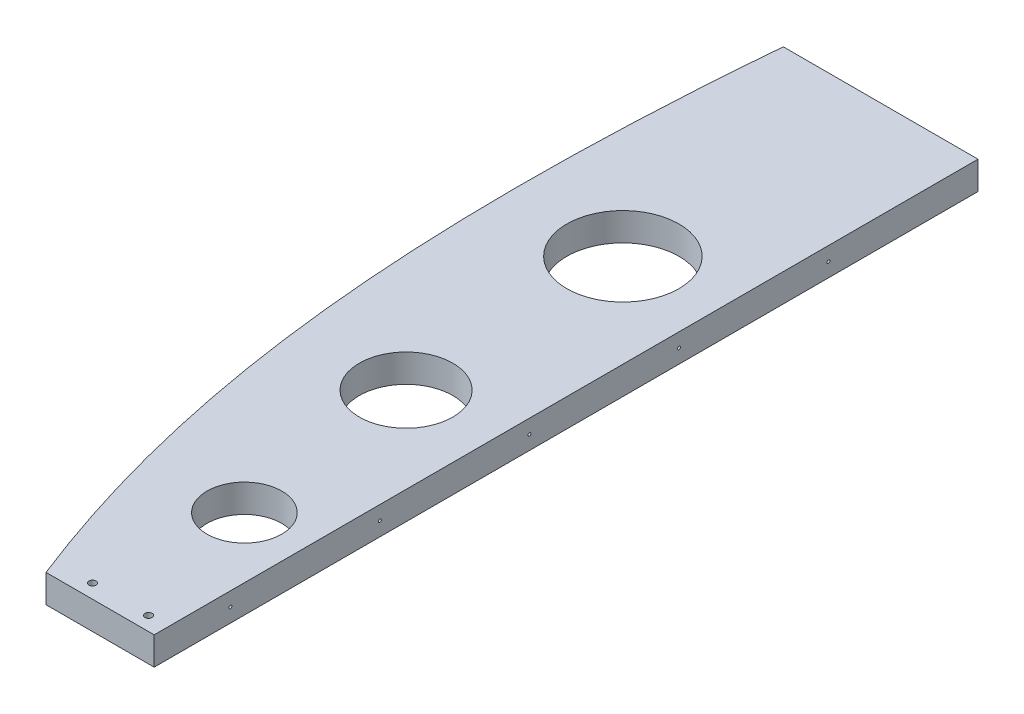
ISO-10303-21;
HEADER;
FILE_DESCRIPTION(('STEP AP214'),'2;1');
FILE_NAME('part.step','',(''),(''),'','','');
FILE_SCHEMA(('AUTOMOTIVE_DESIGN { 1 0 10303 214 1 1 1 1 }'));
ENDSEC;
DATA;
#1=APPLICATION_CONTEXT('core data for automotive mechanical design processes');
#2=APPLICATION_PROTOCOL_DEFINITION('international standard','automotive_design',2000,#1);
#3=PRODUCT_CONTEXT('',#1,'mechanical');
#4=PRODUCT('Part','Part','',(#3));
#5=PRODUCT_RELATED_PRODUCT_CATEGORY('part','',(#4));
#6=PRODUCT_DEFINITION_FORMATION('','',#4);
#7=PRODUCT_DEFINITION_CONTEXT('part definition',#1,'design');
#8=PRODUCT_DEFINITION('design','',#6,#7);
#9=PRODUCT_DEFINITION_SHAPE('','',#8);
#10=(LENGTH_UNIT() NAMED_UNIT(*) SI_UNIT(.MILLI.,.METRE.));
#11=(NAMED_UNIT(*) PLANE_ANGLE_UNIT() SI_UNIT($,.RADIAN.));
#12=(NAMED_UNIT(*) SI_UNIT($,.STERADIAN.) SOLID_ANGLE_UNIT());
#13=UNCERTAINTY_MEASURE_WITH_UNIT(LENGTH_MEASURE(1.E-05),#10,'distance_accuracy_value','');
#14=(GEOMETRIC_REPRESENTATION_CONTEXT(3) GLOBAL_UNCERTAINTY_ASSIGNED_CONTEXT((#13)) GLOBAL_UNIT_ASSIGNED_CONTEXT((#10,
#11,#12)) REPRESENTATION_CONTEXT('',''));
#15=CARTESIAN_POINT('',(0.,0.,0.));
#16=DIRECTION('',(0.,0.,1.));
#17=DIRECTION('',(1.,0.,0.));
#18=AXIS2_PLACEMENT_3D('',#15,#16,#17);
#19=CARTESIAN_POINT('',(-395.938510352721,5549.9,2963.39820667187));
#20=DIRECTION('',(0.,1.,0.));
#21=DIRECTION('',(1.,0.,0.));
#22=AXIS2_PLACEMENT_3D('',#19,#20,#21);
#23=PLANE('',#22);
#24=CARTESIAN_POINT('',(-376.528681754789,5549.9,3233.76141324194));
#25=DIRECTION('',(0.,-1.,0.));
#26=DIRECTION('',(1.,0.,0.));
#27=AXIS2_PLACEMENT_3D('',#24,#25,#26);
#28=CIRCLE('',#27,2.45744999999997);
#29=CARTESIAN_POINT('',(-374.071231754789,5549.9,3233.76141324194));
#30=VERTEX_POINT('',#29);
#31=EDGE_CURVE('E459',#30,#30,#28,.T.);
#32=ORIENTED_EDGE('',*,*,#31,.F.);
#33=EDGE_LOOP('',(#32));
#34=FACE_BOUND('',#33,.T.);
#35=CARTESIAN_POINT('',(-338.428578956982,5549.9,3233.76141324205));
#36=DIRECTION('',(0.,-1.,0.));
#37=DIRECTION('',(1.,0.,0.));
#38=AXIS2_PLACEMENT_3D('',#35,#36,#37);
#39=CIRCLE('',#38,2.45744999999997);
#40=CARTESIAN_POINT('',(-335.971128956982,5549.9,3233.76141324205));
#41=VERTEX_POINT('',#40);
#42=EDGE_CURVE('E116',#41,#41,#39,.T.);
#43=ORIENTED_EDGE('',*,*,#42,.F.);
#44=EDGE_LOOP('',(#43));
#45=FACE_BOUND('',#44,.T.);
#46=CARTESIAN_POINT('',(-388.619999999984,5549.9,2861.31));
#47=DIRECTION('',(0.,-1.,0.));
#48=DIRECTION('',(1.,0.,0.));
#49=AXIS2_PLACEMENT_3D('',#46,#47,#48);
#50=CIRCLE('',#49,38.0999999999997);
#51=CARTESIAN_POINT('',(-350.519999999985,5549.9,2861.31));
#52=VERTEX_POINT('',#51);
#53=EDGE_CURVE('E156',#52,#52,#50,.T.);
#54=ORIENTED_EDGE('',*,*,#53,.F.);
#55=EDGE_LOOP('',(#54));
#56=FACE_BOUND('',#55,.T.);
#57=CARTESIAN_POINT('',(-383.539999999984,5549.9,3013.71));
#58=DIRECTION('',(0.,-1.,0.));
#59=DIRECTION('',(1.,0.,0.));
#60=AXIS2_PLACEMENT_3D('',#57,#58,#59);
#61=CIRCLE('',#60,31.75);
#62=CARTESIAN_POINT('',(-351.789999999984,5549.9,3013.71));
#63=VERTEX_POINT('',#62);
#64=EDGE_CURVE('E484',#63,#63,#61,.T.);
#65=ORIENTED_EDGE('',*,*,#64,.F.);
#66=EDGE_LOOP('',(#65));
#67=FACE_BOUND('',#66,.T.);
#68=CARTESIAN_POINT('',(-366.394999999984,5549.9,3140.71));
#69=DIRECTION('',(0.,-1.,0.));
#70=DIRECTION('',(1.,0.,0.));
#71=AXIS2_PLACEMENT_3D('',#68,#69,#70);
#72=CIRCLE('',#71,25.4);
#73=CARTESIAN_POINT('',(-340.994999999984,5549.9,3140.71));
#74=VERTEX_POINT('',#73);
#75=EDGE_CURVE('E169',#74,#74,#72,.T.);
#76=ORIENTED_EDGE('',*,*,#75,.F.);
#77=EDGE_LOOP('',(#76));
#78=FACE_BOUND('',#77,.T.);
#79=DIRECTION('',(0.,0.,1.));
#80=VECTOR('',#79,1.);
#81=CARTESIAN_POINT('',(-325.12,5549.9,2683.51));
#82=LINE('',#81,#80);
#83=CARTESIAN_POINT('',(-325.12,5549.9,2683.51));
#84=VERTEX_POINT('',#83);
#85=CARTESIAN_POINT('',(-325.12,5549.9,3243.28641334377));
#86=VERTEX_POINT('',#85);
#87=EDGE_CURVE('E161',#84,#86,#82,.T.);
#88=ORIENTED_EDGE('',*,*,#87,.T.);
#89=DIRECTION('',(-1.,0.,0.));
#90=VECTOR('',#89,1.);
#91=CARTESIAN_POINT('',(-325.12,5549.9,3243.28641334377));
#92=LINE('',#91,#90);
#93=CARTESIAN_POINT('',(-398.616067459075,5549.9,3243.28641334377));
#94=VERTEX_POINT('',#93);
#95=EDGE_CURVE('E187',#86,#94,#92,.T.);
#96=ORIENTED_EDGE('',*,*,#95,.T.);
#97=CARTESIAN_POINT('',(-398.616067459075,5549.9,3243.28641334377));
#98=CARTESIAN_POINT('',(-399.391254354249,5549.9,3241.31643941946));
#99=CARTESIAN_POINT('',(-400.159771946542,5549.9,3239.34384037501));
#100=CARTESIAN_POINT('',(-401.683308273386,5549.9,3235.39352604281));
#101=CARTESIAN_POINT('',(-402.438327540984,5549.9,3233.41581096063));
#102=CARTESIAN_POINT('',(-403.934753074234,5549.9,3229.45528302953));
#103=CARTESIAN_POINT('',(-404.676159617437,5549.9,3227.47247028548));
#104=CARTESIAN_POINT('',(-406.145485254066,5549.9,3223.50115186715));
#105=CARTESIAN_POINT('',(-406.873400073381,5549.9,3221.51264461165));
#106=CARTESIAN_POINT('',(-408.315409595479,5549.9,3217.53057616089));
#107=CARTESIAN_POINT('',(-409.029504010926,5549.9,3215.53701486152));
#108=CARTESIAN_POINT('',(-410.443784650398,5549.9,3211.54487773681));
#109=CARTESIAN_POINT('',(-411.143970279183,5549.9,3209.54630170097));
#110=CARTESIAN_POINT('',(-413.924796825673,5549.9,3201.51873163861));
#111=CARTESIAN_POINT('',(-415.948841486582,5549.9,3195.46999950884));
#112=CARTESIAN_POINT('',(-419.867867500471,5549.9,3183.33007269644));
#113=CARTESIAN_POINT('',(-421.762832082676,5549.9,3177.23887260906));
#114=CARTESIAN_POINT('',(-425.422427121145,5549.9,3165.01700514526));
#115=CARTESIAN_POINT('',(-427.187049310552,5549.9,3158.88633529227));
#116=CARTESIAN_POINT('',(-430.585512685608,5549.9,3146.58889174867));
#117=CARTESIAN_POINT('',(-432.219354382257,5549.9,3140.42211819922));
#118=CARTESIAN_POINT('',(-435.357372122892,5549.9,3128.05321738843));
#119=CARTESIAN_POINT('',(-436.86149932901,5549.9,3121.85107774053));
#120=CARTESIAN_POINT('',(-439.740649568868,5549.9,3109.41710957125));
#121=CARTESIAN_POINT('',(-441.115676283978,5549.9,3103.18528190178));
#122=CARTESIAN_POINT('',(-443.738657817965,5549.9,3090.69501786939));
#123=CARTESIAN_POINT('',(-444.986613882393,5549.9,3084.43658176791));
#124=CARTESIAN_POINT('',(-447.358070937325,5549.9,3071.89634733286));
#125=CARTESIAN_POINT('',(-448.481574270177,5549.9,3065.61454944128));
#126=CARTESIAN_POINT('',(-450.9592027724,5549.9,3050.94728471009));
#127=CARTESIAN_POINT('',(-452.266536668403,5549.9,3042.553883485));
#128=CARTESIAN_POINT('',(-454.674970323465,5549.9,3025.73760485585));
#129=CARTESIAN_POINT('',(-455.776068123823,5549.9,3017.3147271726));
#130=CARTESIAN_POINT('',(-457.781734473296,5549.9,3000.44559812987));
#131=CARTESIAN_POINT('',(-458.686301386225,5549.9,2991.99934657639));
#132=CARTESIAN_POINT('',(-460.309158182782,5549.9,2975.08983570134));
#133=CARTESIAN_POINT('',(-461.027464844443,5549.9,2966.62657798091));
#134=CARTESIAN_POINT('',(-462.288581630136,5549.9,2949.68715658898));
#135=CARTESIAN_POINT('',(-462.831394684957,5549.9,2941.21099313538));
#136=CARTESIAN_POINT('',(-463.522040592226,5549.9,2928.49034900381));
#137=CARTESIAN_POINT('',(-463.73165863672,5549.9,2924.2491150432));
#138=CARTESIAN_POINT('',(-464.111045111048,5549.9,2915.76485644083));
#139=CARTESIAN_POINT('',(-464.280813611034,5549.9,2911.52183180224));
#140=CARTESIAN_POINT('',(-464.543893782736,5549.9,2904.10341936462));
#141=CARTESIAN_POINT('',(-464.645692509932,5549.9,2900.92832853059));
#142=CARTESIAN_POINT('',(-464.782642510266,5549.9,2896.16524637707));
#143=CARTESIAN_POINT('',(-464.825667804945,5549.9,2894.57747907896));
#144=CARTESIAN_POINT('',(-464.906437301377,5549.9,2891.40180867515));
#145=CARTESIAN_POINT('',(-464.944181497302,5549.9,2889.81390556928));
#146=CARTESIAN_POINT('',(-465.049630713982,5549.9,2885.05012986422));
#147=CARTESIAN_POINT('',(-465.109555502826,5549.9,2881.87408139542));
#148=CARTESIAN_POINT('',(-465.209293669797,5549.9,2875.52166888438));
#149=CARTESIAN_POINT('',(-465.24910699861,5549.9,2872.34530484138));
#150=CARTESIAN_POINT('',(-465.339279193302,5549.9,2862.81707241095));
#151=CARTESIAN_POINT('',(-465.360395446423,5549.9,2856.46490585253));
#152=CARTESIAN_POINT('',(-465.328911747632,5549.9,2843.76069302108));
#153=CARTESIAN_POINT('',(-465.276310667106,5549.9,2837.40864675138));
#154=CARTESIAN_POINT('',(-465.10371715051,5549.9,2824.90056477656));
#155=CARTESIAN_POINT('',(-464.985843659626,5549.9,2818.74449953624));
#156=CARTESIAN_POINT('',(-464.687072530091,5549.9,2806.43379985709));
#157=CARTESIAN_POINT('',(-464.506173786314,5549.9,2800.27916544525));
#158=CARTESIAN_POINT('',(-464.083727288669,5549.9,2787.97184820662));
#159=CARTESIAN_POINT('',(-463.842178185526,5549.9,2781.81916542631));
#160=CARTESIAN_POINT('',(-463.300390781291,5549.9,2769.51628781189));
#161=CARTESIAN_POINT('',(-463.000151506003,5549.9,2763.36609302079));
#162=CARTESIAN_POINT('',(-462.342479114975,5549.9,2751.06749509507));
#163=CARTESIAN_POINT('',(-461.98503422991,5549.9,2744.91909259054));
#164=CARTESIAN_POINT('',(-461.214161076097,5549.9,2732.62589828629));
#165=CARTESIAN_POINT('',(-460.800733667989,5549.9,2726.48110643251));
#166=CARTESIAN_POINT('',(-459.918658659862,5549.9,2714.19573926707));
#167=CARTESIAN_POINT('',(-459.450013380929,5549.9,2708.05516378908));
#168=CARTESIAN_POINT('',(-458.705858250388,5549.9,2698.84786595679));
#169=CARTESIAN_POINT('',(-458.450951410517,5549.9,2695.77946560644));
#170=CARTESIAN_POINT('',(-457.927384186114,5549.9,2689.64383870023));
#171=CARTESIAN_POINT('',(-457.658723802265,5549.9,2686.57661214431));
#172=CARTESIAN_POINT('',(-457.383176281734,5549.9,2683.51));
#173=B_SPLINE_CURVE_WITH_KNOTS('',3,(#97,#98,#99,#100,#101,#102,#103,#104,#105,#106,#107,#108,
#109,#110,#111,#112,#113,#114,#115,#116,#117,#118,#119,#120,#121,#122,#123,#124,#125,#126,#127,
#128,#129,#130,#131,#132,#133,#134,#135,#136,#137,#138,#139,#140,#141,#142,#143,#144,#145,#146,
#147,#148,#149,#150,#151,#152,#153,#154,#155,#156,#157,#158,#159,#160,#161,#162,#163,#164,#165,
#166,#167,#168,#169,#170,#171,#172),.UNSPECIFIED.,.F.,.F.,(4,2,2,2,2,2,2,2,2,2,2,2,2,2,2,2,2,2,
2,2,2,2,2,2,2,2,2,2,2,2,2,2,2,2,2,2,2,4),(0.,6.35100513389818,12.7017589115666,19.0523830586233,
25.4049858028807,31.7577204810343,38.110726446763,57.2443005221602,76.3803558108264,
95.5176237474086,114.654816904936,133.799184095804,152.943005208753,172.086638655152,
191.229911734633,216.710911962581,242.192154180931,267.673608531116,293.152766753605,
318.631499445493,331.370582215211,344.109642558367,353.639740098638,358.404782446424,
363.169830052399,372.699596689318,382.229386692556,401.285492509783,420.34189008003,
438.813133582084,457.284700987463,475.756679362759,494.228964380042,512.705054731665,
531.18086107531,549.655891064217,558.892775373889,568.129659224019),.UNSPECIFIED.);
#174=CARTESIAN_POINT('',(-457.383176281734,5549.9,2683.51));
#175=VERTEX_POINT('',#174);
#176=EDGE_CURVE('E174',#94,#175,#173,.T.);
#177=ORIENTED_EDGE('',*,*,#176,.T.);
#178=DIRECTION('',(1.,0.,0.));
#179=VECTOR('',#178,1.);
#180=CARTESIAN_POINT('',(-457.383176281734,5549.9,2683.51));
#181=LINE('',#180,#179);
#182=EDGE_CURVE('E162',#175,#84,#181,.T.);
#183=ORIENTED_EDGE('',*,*,#182,.T.);
#184=EDGE_LOOP('',(#88,#96,#177,#183));
#185=FACE_BOUND('',#184,.T.);
#186=ADVANCED_FACE('F37',(#34,#45,#56,#67,#78,#185),#23,.F.);
#187=CARTESIAN_POINT('',(-325.12,5549.9,3243.28641334377));
#188=DIRECTION('',(0.,0.,1.));
#189=DIRECTION('',(-1.,0.,0.));
#190=AXIS2_PLACEMENT_3D('',#187,#188,#189);
#191=PLANE('',#190);
#192=DIRECTION('',(1.,0.,0.));
#193=VECTOR('',#192,1.);
#194=CARTESIAN_POINT('',(-395.938510352721,5568.95,3243.28641334377));
#195=LINE('',#194,#193);
#196=CARTESIAN_POINT('',(-325.12,5568.95,3243.28641334377));
#197=VERTEX_POINT('',#196);
#198=CARTESIAN_POINT('',(-398.616067459077,5568.95,3243.28641334377));
#199=VERTEX_POINT('',#198);
#200=EDGE_CURVE('E154',#197,#199,#195,.F.);
#201=ORIENTED_EDGE('',*,*,#200,.T.);
#202=DIRECTION('',(1.36956646082368E-13,-1.,0.));
#203=VECTOR('',#202,1.);
#204=CARTESIAN_POINT('',(-398.616067459076,5559.425,3243.28641334377));
#205=LINE('',#204,#203);
#206=EDGE_CURVE('E82',#199,#94,#205,.T.);
#207=ORIENTED_EDGE('',*,*,#206,.T.);
#208=ORIENTED_EDGE('',*,*,#95,.F.);
#209=DIRECTION('',(0.,-1.,0.));
#210=VECTOR('',#209,1.);
#211=CARTESIAN_POINT('',(-325.12,5549.9,3243.28641334377));
#212=LINE('',#211,#210);
#213=EDGE_CURVE('E170',#86,#197,#212,.F.);
#214=ORIENTED_EDGE('',*,*,#213,.T.);
#215=EDGE_LOOP('',(#201,#207,#208,#214));
#216=FACE_BOUND('',#215,.T.);
#217=ADVANCED_FACE('F232',(#216),#191,.T.);
#218=CARTESIAN_POINT('',(-398.616067459075,5549.9,3243.28641334377));
#219=CARTESIAN_POINT('',(-398.616067459077,5568.95,3243.28641334377));
#220=CARTESIAN_POINT('',(-438.958601174539,5549.9,3140.76412449457));
#221=CARTESIAN_POINT('',(-438.958601174542,5568.95,3140.76412449457));
#222=CARTESIAN_POINT('',(-461.136779739803,5549.9,3031.41462020298));
#223=CARTESIAN_POINT('',(-461.136779739803,5568.95,3031.41462020298));
#224=CARTESIAN_POINT('',(-466.748734721918,5549.9,2823.19952309334));
#225=CARTESIAN_POINT('',(-466.748734721918,5568.95,2823.19952309334));
#226=CARTESIAN_POINT('',(-463.282210542618,5549.9,2749.16015817366));
#227=CARTESIAN_POINT('',(-463.282210542618,5568.95,2749.16015817366));
#228=CARTESIAN_POINT('',(-457.383176281734,5549.9,2683.51));
#229=CARTESIAN_POINT('',(-457.383176281734,5568.95,2683.51));
#230=B_SPLINE_SURFACE_WITH_KNOTS('',3,1,((#218,#219),(#220,#221),(#222,#223),(#224,#225),(#226,
#227),(#228,#229)),.UNSPECIFIED.,.F.,.F.,.F.,(4,2,4),(2,2),(-55.3716029639308,-25.0699273348478,
-9.0667694452729),(0.,1.90499999999997),.UNSPECIFIED.);
#231=CARTESIAN_POINT('',(-398.616067459077,5568.95,3243.28641334377));
#232=CARTESIAN_POINT('',(-399.391254354252,5568.95,3241.31643941946));
#233=CARTESIAN_POINT('',(-400.159771946544,5568.95,3239.34384037501));
#234=CARTESIAN_POINT('',(-401.683308273389,5568.95,3235.39352604281));
#235=CARTESIAN_POINT('',(-402.438327540987,5568.95,3233.41581096063));
#236=CARTESIAN_POINT('',(-403.934753074236,5568.95,3229.45528302953));
#237=CARTESIAN_POINT('',(-404.67615961744,5568.95,3227.47247028548));
#238=CARTESIAN_POINT('',(-406.145485254068,5568.95,3223.50115186715));
#239=CARTESIAN_POINT('',(-406.873400073383,5568.95,3221.51264461165));
#240=CARTESIAN_POINT('',(-408.315409595482,5568.95,3217.53057616089));
#241=CARTESIAN_POINT('',(-409.029504010929,5568.95,3215.53701486152));
#242=CARTESIAN_POINT('',(-410.443784650401,5568.95,3211.54487773681));
#243=CARTESIAN_POINT('',(-411.143970279186,5568.95,3209.54630170097));
#244=CARTESIAN_POINT('',(-413.924796825675,5568.95,3201.51873163861));
#245=CARTESIAN_POINT('',(-415.948841486584,5568.95,3195.46999950884));
#246=CARTESIAN_POINT('',(-419.867867500473,5568.95,3183.33007269644));
#247=CARTESIAN_POINT('',(-421.762832082679,5568.95,3177.23887260905));
#248=CARTESIAN_POINT('',(-425.422427121148,5568.95,3165.01700514525));
#249=CARTESIAN_POINT('',(-427.187049310555,5568.95,3158.88633529227));
#250=CARTESIAN_POINT('',(-430.58551268561,5568.95,3146.58889174867));
#251=CARTESIAN_POINT('',(-432.21935438226,5568.95,3140.42211819922));
#252=CARTESIAN_POINT('',(-435.357372122894,5568.95,3128.05321738843));
#253=CARTESIAN_POINT('',(-436.861499329012,5568.95,3121.85107774053));
#254=CARTESIAN_POINT('',(-439.74064956887,5568.95,3109.41710957125));
#255=CARTESIAN_POINT('',(-441.11567628398,5568.95,3103.18528190178));
#256=CARTESIAN_POINT('',(-443.738657817967,5568.95,3090.69501786939));
#257=CARTESIAN_POINT('',(-444.986613882395,5568.95,3084.43658176791));
#258=CARTESIAN_POINT('',(-447.358070937327,5568.95,3071.89634733286));
#259=CARTESIAN_POINT('',(-448.481574270178,5568.95,3065.61454944128));
#260=CARTESIAN_POINT('',(-450.959202772401,5568.95,3050.94728471008));
#261=CARTESIAN_POINT('',(-452.266536668404,5568.95,3042.553883485));
#262=CARTESIAN_POINT('',(-454.674970323466,5568.95,3025.73760485584));
#263=CARTESIAN_POINT('',(-455.776068123824,5568.95,3017.3147271726));
#264=CARTESIAN_POINT('',(-457.781734473297,5568.95,3000.44559812987));
#265=CARTESIAN_POINT('',(-458.686301386226,5568.95,2991.99934657639));
#266=CARTESIAN_POINT('',(-460.309158182783,5568.95,2975.08983570133));
#267=CARTESIAN_POINT('',(-461.027464844443,5568.95,2966.62657798091));
#268=CARTESIAN_POINT('',(-462.288581630136,5568.95,2949.68715658898));
#269=CARTESIAN_POINT('',(-462.831394684957,5568.95,2941.21099313538));
#270=CARTESIAN_POINT('',(-463.522040592226,5568.95,2928.49034900381));
#271=CARTESIAN_POINT('',(-463.73165863672,5568.95,2924.2491150432));
#272=CARTESIAN_POINT('',(-464.111045111048,5568.95,2915.76485644083));
#273=CARTESIAN_POINT('',(-464.280813611034,5568.95,2911.52183180224));
#274=CARTESIAN_POINT('',(-464.543893782736,5568.95,2904.10341936462));
#275=CARTESIAN_POINT('',(-464.645692509933,5568.95,2900.92832853059));
#276=CARTESIAN_POINT('',(-464.782642510266,5568.95,2896.16524637706));
#277=CARTESIAN_POINT('',(-464.825667804945,5568.95,2894.57747907896));
#278=CARTESIAN_POINT('',(-464.906437301377,5568.95,2891.40180867514));
#279=CARTESIAN_POINT('',(-464.944181497302,5568.95,2889.81390556928));
#280=CARTESIAN_POINT('',(-465.049630713982,5568.95,2885.05012986421));
#281=CARTESIAN_POINT('',(-465.109555502827,5568.95,2881.87408139542));
#282=CARTESIAN_POINT('',(-465.209293669797,5568.95,2875.52166888437));
#283=CARTESIAN_POINT('',(-465.24910699861,5568.95,2872.34530484138));
#284=CARTESIAN_POINT('',(-465.339279193302,5568.95,2862.81707241094));
#285=CARTESIAN_POINT('',(-465.360395446423,5568.95,2856.46490585253));
#286=CARTESIAN_POINT('',(-465.328911747632,5568.95,2843.76069302108));
#287=CARTESIAN_POINT('',(-465.276310667106,5568.95,2837.40864675138));
#288=CARTESIAN_POINT('',(-465.10371715051,5568.95,2824.90056477656));
#289=CARTESIAN_POINT('',(-464.985843659626,5568.95,2818.74449953624));
#290=CARTESIAN_POINT('',(-464.687072530091,5568.95,2806.43379985709));
#291=CARTESIAN_POINT('',(-464.506173786313,5568.95,2800.27916544525));
#292=CARTESIAN_POINT('',(-464.083727288669,5568.95,2787.97184820662));
#293=CARTESIAN_POINT('',(-463.842178185526,5568.95,2781.81916542631));
#294=CARTESIAN_POINT('',(-463.300390781291,5568.95,2769.51628781189));
#295=CARTESIAN_POINT('',(-463.000151506003,5568.95,2763.36609302078));
#296=CARTESIAN_POINT('',(-462.342479114975,5568.95,2751.06749509507));
#297=CARTESIAN_POINT('',(-461.98503422991,5568.95,2744.91909259054));
#298=CARTESIAN_POINT('',(-461.214161076097,5568.95,2732.62589828628));
#299=CARTESIAN_POINT('',(-460.800733667989,5568.95,2726.48110643251));
#300=CARTESIAN_POINT('',(-459.918658659862,5568.95,2714.19573926707));
#301=CARTESIAN_POINT('',(-459.450013380929,5568.95,2708.05516378908));
#302=CARTESIAN_POINT('',(-458.705858250388,5568.95,2698.84786595678));
#303=CARTESIAN_POINT('',(-458.450951410517,5568.95,2695.77946560644));
#304=CARTESIAN_POINT('',(-457.927384186114,5568.95,2689.64383870023));
#305=CARTESIAN_POINT('',(-457.658723802265,5568.95,2686.57661214431));
#306=CARTESIAN_POINT('',(-457.383176281734,5568.95,2683.51));
#307=B_SPLINE_CURVE_WITH_KNOTS('',3,(#231,#232,#233,#234,#235,#236,#237,#238,#239,#240,#241,
#242,#243,#244,#245,#246,#247,#248,#249,#250,#251,#252,#253,#254,#255,#256,#257,#258,#259,#260,
#261,#262,#263,#264,#265,#266,#267,#268,#269,#270,#271,#272,#273,#274,#275,#276,#277,#278,#279,
#280,#281,#282,#283,#284,#285,#286,#287,#288,#289,#290,#291,#292,#293,#294,#295,#296,#297,#298,
#299,#300,#301,#302,#303,#304,#305,#306),.UNSPECIFIED.,.F.,.F.,(4,2,2,2,2,2,2,2,2,2,2,2,2,2,2,2,
2,2,2,2,2,2,2,2,2,2,2,2,2,2,2,2,2,2,2,2,2,4),(0.,6.35100513389873,12.7017589115675,
19.052383058624,25.4049858028812,31.7577204810353,38.1107264467643,57.2443005221619,
76.3803558108276,95.5176237474098,114.654816904938,133.799184095806,152.943005208755,
172.086638655154,191.229911734635,216.710911962584,242.192154180932,267.673608531119,
293.152766753607,318.631499445496,331.370582215213,344.109642558369,353.63974009864,
358.404782446426,363.169830052401,372.69959668932,382.229386692558,401.285492509786,
420.341890080032,438.813133582086,457.284700987465,475.756679362761,494.228964380043,
512.705054731665,531.180861075311,549.655891064217,558.892775373888,568.129659224018),.UNSPECIFIED.);
#308=CARTESIAN_POINT('',(-457.383176281734,5568.95,2683.51));
#309=VERTEX_POINT('',#308);
#310=EDGE_CURVE('E151',#199,#309,#307,.T.);
#311=DIRECTION('',(0.,1.,0.));
#312=VECTOR('',#311,1.);
#313=CARTESIAN_POINT('',(-457.383176281734,5549.9,2683.51));
#314=LINE('',#313,#312);
#315=EDGE_CURVE('E159',#309,#175,#314,.F.);
#316=ORIENTED_EDGE('',*,*,#310,.T.);
#317=ORIENTED_EDGE('',*,*,#315,.T.);
#318=ORIENTED_EDGE('',*,*,#176,.F.);
#319=ORIENTED_EDGE('',*,*,#206,.F.);
#320=EDGE_LOOP('',(#316,#317,#318,#319));
#321=FACE_BOUND('',#320,.T.);
#322=ADVANCED_FACE('F39',(#321),#230,.F.);
#323=CARTESIAN_POINT('',(-457.383176281734,5549.9,2683.51));
#324=DIRECTION('',(0.,0.,-1.));
#325=DIRECTION('',(1.,0.,0.));
#326=AXIS2_PLACEMENT_3D('',#323,#324,#325);
#327=PLANE('',#326);
#328=CARTESIAN_POINT('',(-424.072610901228,5559.425,2683.51));
#329=DIRECTION('',(0.,0.,1.));
#330=DIRECTION('',(1.,0.,0.));
#331=AXIS2_PLACEMENT_3D('',#328,#329,#330);
#332=CIRCLE('',#331,0.991870000000006);
#333=CARTESIAN_POINT('',(-423.080740901228,5559.425,2683.51));
#334=VERTEX_POINT('',#333);
#335=EDGE_CURVE('E143',#334,#334,#332,.T.);
#336=ORIENTED_EDGE('',*,*,#335,.T.);
#337=EDGE_LOOP('',(#336));
#338=FACE_BOUND('',#337,.T.);
#339=CARTESIAN_POINT('',(-358.104203633743,5559.425,2683.51));
#340=DIRECTION('',(0.,0.,1.));
#341=DIRECTION('',(1.,0.,0.));
#342=AXIS2_PLACEMENT_3D('',#339,#340,#341);
#343=CIRCLE('',#342,0.991870000000006);
#344=CARTESIAN_POINT('',(-357.112333633743,5559.425,2683.51));
#345=VERTEX_POINT('',#344);
#346=EDGE_CURVE('E147',#345,#345,#343,.T.);
#347=ORIENTED_EDGE('',*,*,#346,.T.);
#348=EDGE_LOOP('',(#347));
#349=FACE_BOUND('',#348,.T.);
#350=DIRECTION('',(1.,0.,0.));
#351=VECTOR('',#350,1.);
#352=CARTESIAN_POINT('',(-395.938510352721,5568.95,2683.51));
#353=LINE('',#352,#351);
#354=CARTESIAN_POINT('',(-325.12,5568.95,2683.51));
#355=VERTEX_POINT('',#354);
#356=EDGE_CURVE('E148',#309,#355,#353,.T.);
#357=ORIENTED_EDGE('',*,*,#356,.T.);
#358=DIRECTION('',(0.,-1.,0.));
#359=VECTOR('',#358,1.);
#360=CARTESIAN_POINT('',(-325.12,5549.9,2683.51));
#361=LINE('',#360,#359);
#362=EDGE_CURVE('E167',#355,#84,#361,.T.);
#363=ORIENTED_EDGE('',*,*,#362,.T.);
#364=ORIENTED_EDGE('',*,*,#182,.F.);
#365=ORIENTED_EDGE('',*,*,#315,.F.);
#366=EDGE_LOOP('',(#357,#363,#364,#365));
#367=FACE_BOUND('',#366,.T.);
#368=ADVANCED_FACE('F227',(#338,#349,#367),#327,.T.);
#369=CARTESIAN_POINT('',(-325.12,5549.9,2683.51));
#370=DIRECTION('',(1.,0.,0.));
#371=DIRECTION('',(0.,-1.,0.));
#372=AXIS2_PLACEMENT_3D('',#369,#370,#371);
#373=PLANE('',#372);
#374=CARTESIAN_POINT('',(-325.12,5559.425,2785.11));
#375=DIRECTION('',(-1.,0.,0.));
#376=DIRECTION('',(0.,-1.,0.));
#377=AXIS2_PLACEMENT_3D('',#374,#375,#376);
#378=CIRCLE('',#377,0.991870000000006);
#379=CARTESIAN_POINT('',(-325.12,5558.43313,2785.11));
#380=VERTEX_POINT('',#379);
#381=EDGE_CURVE('E44',#380,#380,#378,.T.);
#382=ORIENTED_EDGE('',*,*,#381,.T.);
#383=EDGE_LOOP('',(#382));
#384=FACE_BOUND('',#383,.T.);
#385=CARTESIAN_POINT('',(-325.12,5559.425,2886.71));
#386=DIRECTION('',(-1.,0.,0.));
#387=DIRECTION('',(0.,-1.,0.));
#388=AXIS2_PLACEMENT_3D('',#385,#386,#387);
#389=CIRCLE('',#388,0.991870000000006);
#390=CARTESIAN_POINT('',(-325.12,5558.43313,2886.71));
#391=VERTEX_POINT('',#390);
#392=EDGE_CURVE('E127',#391,#391,#389,.T.);
#393=ORIENTED_EDGE('',*,*,#392,.T.);
#394=EDGE_LOOP('',(#393));
#395=FACE_BOUND('',#394,.T.);
#396=CARTESIAN_POINT('',(-325.12,5559.425,2988.31));
#397=DIRECTION('',(-1.,0.,0.));
#398=DIRECTION('',(0.,-1.,0.));
#399=AXIS2_PLACEMENT_3D('',#396,#397,#398);
#400=CIRCLE('',#399,0.991870000000006);
#401=CARTESIAN_POINT('',(-325.12,5558.43313,2988.31));
#402=VERTEX_POINT('',#401);
#403=EDGE_CURVE('E131',#402,#402,#400,.T.);
#404=ORIENTED_EDGE('',*,*,#403,.T.);
#405=EDGE_LOOP('',(#404));
#406=FACE_BOUND('',#405,.T.);
#407=CARTESIAN_POINT('',(-325.12,5559.425,3089.91));
#408=DIRECTION('',(-1.,0.,0.));
#409=DIRECTION('',(0.,-1.,0.));
#410=AXIS2_PLACEMENT_3D('',#407,#408,#409);
#411=CIRCLE('',#410,0.991870000000006);
#412=CARTESIAN_POINT('',(-325.12,5558.43313,3089.91));
#413=VERTEX_POINT('',#412);
#414=EDGE_CURVE('E135',#413,#413,#411,.T.);
#415=ORIENTED_EDGE('',*,*,#414,.T.);
#416=EDGE_LOOP('',(#415));
#417=FACE_BOUND('',#416,.T.);
#418=CARTESIAN_POINT('',(-325.12,5559.425,3191.51));
#419=DIRECTION('',(-1.,0.,0.));
#420=DIRECTION('',(0.,-1.,0.));
#421=AXIS2_PLACEMENT_3D('',#418,#419,#420);
#422=CIRCLE('',#421,0.991870000000006);
#423=CARTESIAN_POINT('',(-325.12,5558.43313,3191.51));
#424=VERTEX_POINT('',#423);
#425=EDGE_CURVE('E139',#424,#424,#422,.T.);
#426=ORIENTED_EDGE('',*,*,#425,.T.);
#427=EDGE_LOOP('',(#426));
#428=FACE_BOUND('',#427,.T.);
#429=DIRECTION('',(0.,0.,1.));
#430=VECTOR('',#429,1.);
#431=CARTESIAN_POINT('',(-325.12,5568.95,2963.39820667187));
#432=LINE('',#431,#430);
#433=EDGE_CURVE('E59',#355,#197,#432,.T.);
#434=ORIENTED_EDGE('',*,*,#433,.T.);
#435=ORIENTED_EDGE('',*,*,#213,.F.);
#436=ORIENTED_EDGE('',*,*,#87,.F.);
#437=ORIENTED_EDGE('',*,*,#362,.F.);
#438=EDGE_LOOP('',(#434,#435,#436,#437));
#439=FACE_BOUND('',#438,.T.);
#440=ADVANCED_FACE('F223',(#384,#395,#406,#417,#428,#439),#373,.T.);
#441=CARTESIAN_POINT('',(-366.395,5194.3,3140.71));
#442=DIRECTION('',(0.,1.,0.));
#443=DIRECTION('',(1.,0.,0.));
#444=AXIS2_PLACEMENT_3D('',#441,#442,#443);
#445=CYLINDRICAL_SURFACE('',#444,25.4);
#446=ORIENTED_EDGE('',*,*,#75,.T.);
#447=EDGE_LOOP('',(#446));
#448=FACE_BOUND('',#447,.T.);
#449=CARTESIAN_POINT('',(-366.394999999984,5568.95,3140.71));
#450=DIRECTION('',(0.,-1.,0.));
#451=DIRECTION('',(1.,0.,0.));
#452=AXIS2_PLACEMENT_3D('',#449,#450,#451);
#453=CIRCLE('',#452,25.4);
#454=CARTESIAN_POINT('',(-340.994999999984,5568.95,3140.71));
#455=VERTEX_POINT('',#454);
#456=EDGE_CURVE('E164',#455,#455,#453,.F.);
#457=ORIENTED_EDGE('',*,*,#456,.T.);
#458=EDGE_LOOP('',(#457));
#459=FACE_BOUND('',#458,.T.);
#460=ADVANCED_FACE('F219',(#448,#459),#445,.F.);
#461=CARTESIAN_POINT('',(-383.54,5194.3,3013.71));
#462=DIRECTION('',(0.,1.,0.));
#463=DIRECTION('',(1.,0.,0.));
#464=AXIS2_PLACEMENT_3D('',#461,#462,#463);
#465=CYLINDRICAL_SURFACE('',#464,31.75);
#466=ORIENTED_EDGE('',*,*,#64,.T.);
#467=EDGE_LOOP('',(#466));
#468=FACE_BOUND('',#467,.T.);
#469=CARTESIAN_POINT('',(-383.539999999983,5568.95,3013.71));
#470=DIRECTION('',(0.,-1.,0.));
#471=DIRECTION('',(1.,0.,0.));
#472=AXIS2_PLACEMENT_3D('',#469,#470,#471);
#473=CIRCLE('',#472,31.75);
#474=CARTESIAN_POINT('',(-351.789999999983,5568.95,3013.71));
#475=VERTEX_POINT('',#474);
#476=EDGE_CURVE('E50',#475,#475,#473,.F.);
#477=ORIENTED_EDGE('',*,*,#476,.T.);
#478=EDGE_LOOP('',(#477));
#479=FACE_BOUND('',#478,.T.);
#480=ADVANCED_FACE('F215',(#468,#479),#465,.F.);
#481=CARTESIAN_POINT('',(-388.62,5194.3,2861.31));
#482=DIRECTION('',(0.,1.,0.));
#483=DIRECTION('',(1.,0.,0.));
#484=AXIS2_PLACEMENT_3D('',#481,#482,#483);
#485=CYLINDRICAL_SURFACE('',#484,38.0999999999997);
#486=ORIENTED_EDGE('',*,*,#53,.T.);
#487=EDGE_LOOP('',(#486));
#488=FACE_BOUND('',#487,.T.);
#489=CARTESIAN_POINT('',(-388.619999999984,5568.95,2861.31));
#490=DIRECTION('',(0.,-1.,0.));
#491=DIRECTION('',(1.,0.,0.));
#492=AXIS2_PLACEMENT_3D('',#489,#490,#491);
#493=CIRCLE('',#492,38.0999999999997);
#494=CARTESIAN_POINT('',(-350.519999999984,5568.95,2861.31));
#495=VERTEX_POINT('',#494);
#496=EDGE_CURVE('E11',#495,#495,#493,.F.);
#497=ORIENTED_EDGE('',*,*,#496,.T.);
#498=EDGE_LOOP('',(#497));
#499=FACE_BOUND('',#498,.T.);
#500=ADVANCED_FACE('F210',(#488,#499),#485,.F.);
#501=CARTESIAN_POINT('',(-395.938510352721,5568.95,2963.39820667187));
#502=DIRECTION('',(0.,1.,0.));
#503=DIRECTION('',(1.,0.,0.));
#504=AXIS2_PLACEMENT_3D('',#501,#502,#503);
#505=PLANE('',#504);
#506=CARTESIAN_POINT('',(-376.528681754789,5568.95,3233.76141324194));
#507=DIRECTION('',(0.,-1.,0.));
#508=DIRECTION('',(0.,0.,1.));
#509=AXIS2_PLACEMENT_3D('',#506,#507,#508);
#510=CIRCLE('',#509,2.45744999999997);
#511=CARTESIAN_POINT('',(-376.528681754789,5568.95,3236.21886324194));
#512=VERTEX_POINT('',#511);
#513=EDGE_CURVE('E456',#512,#512,#510,.T.);
#514=ORIENTED_EDGE('',*,*,#513,.T.);
#515=EDGE_LOOP('',(#514));
#516=FACE_BOUND('',#515,.T.);
#517=CARTESIAN_POINT('',(-338.428578956982,5568.95,3233.76141324205));
#518=DIRECTION('',(0.,-1.,0.));
#519=DIRECTION('',(0.,0.,1.));
#520=AXIS2_PLACEMENT_3D('',#517,#518,#519);
#521=CIRCLE('',#520,2.45744999999997);
#522=CARTESIAN_POINT('',(-338.428578956982,5568.95,3236.21886324205));
#523=VERTEX_POINT('',#522);
#524=EDGE_CURVE('E121',#523,#523,#521,.T.);
#525=ORIENTED_EDGE('',*,*,#524,.T.);
#526=EDGE_LOOP('',(#525));
#527=FACE_BOUND('',#526,.T.);
#528=ORIENTED_EDGE('',*,*,#496,.F.);
#529=EDGE_LOOP('',(#528));
#530=FACE_BOUND('',#529,.T.);
#531=ORIENTED_EDGE('',*,*,#476,.F.);
#532=EDGE_LOOP('',(#531));
#533=FACE_BOUND('',#532,.T.);
#534=ORIENTED_EDGE('',*,*,#456,.F.);
#535=EDGE_LOOP('',(#534));
#536=FACE_BOUND('',#535,.T.);
#537=ORIENTED_EDGE('',*,*,#356,.F.);
#538=ORIENTED_EDGE('',*,*,#310,.F.);
#539=ORIENTED_EDGE('',*,*,#200,.F.);
#540=ORIENTED_EDGE('',*,*,#433,.F.);
#541=EDGE_LOOP('',(#537,#538,#539,#540));
#542=FACE_BOUND('',#541,.T.);
#543=ADVANCED_FACE('F204',(#516,#527,#530,#533,#536,#542),#505,.T.);
#544=CARTESIAN_POINT('',(-358.104203633743,5559.425,2702.56));
#545=DIRECTION('',(0.,0.,-1.));
#546=DIRECTION('',(1.,0.,0.));
#547=AXIS2_PLACEMENT_3D('',#544,#545,#546);
#548=CONICAL_SURFACE('',#547,0.991870000000006,1.02974425867677);
#549=CARTESIAN_POINT('',(-358.104203633743,5559.425,2703.1559756222));
#550=VERTEX_POINT('',#549);
#551=VERTEX_LOOP('',#550);
#552=FACE_BOUND('',#551,.T.);
#553=CARTESIAN_POINT('',(-358.104203633743,5559.425,2702.56));
#554=DIRECTION('',(0.,0.,1.));
#555=DIRECTION('',(1.,0.,0.));
#556=AXIS2_PLACEMENT_3D('',#553,#554,#555);
#557=CIRCLE('',#556,0.991870000000006);
#558=CARTESIAN_POINT('',(-357.112333633743,5559.425,2702.56));
#559=VERTEX_POINT('',#558);
#560=EDGE_CURVE('E144',#559,#559,#557,.T.);
#561=ORIENTED_EDGE('',*,*,#560,.F.);
#562=EDGE_LOOP('',(#561));
#563=FACE_BOUND('',#562,.T.);
#564=ADVANCED_FACE('F209',(#552,#563),#548,.F.);
#565=CARTESIAN_POINT('',(-358.104203633743,5559.425,2664.46));
#566=DIRECTION('',(0.,0.,-1.));
#567=DIRECTION('',(1.,0.,0.));
#568=AXIS2_PLACEMENT_3D('',#565,#566,#567);
#569=CYLINDRICAL_SURFACE('',#568,0.991870000000006);
#570=ORIENTED_EDGE('',*,*,#346,.F.);
#571=EDGE_LOOP('',(#570));
#572=FACE_BOUND('',#571,.T.);
#573=ORIENTED_EDGE('',*,*,#560,.T.);
#574=EDGE_LOOP('',(#573));
#575=FACE_BOUND('',#574,.T.);
#576=ADVANCED_FACE('F301',(#572,#575),#569,.F.);
#577=CARTESIAN_POINT('',(-424.072610901228,5559.425,2702.56));
#578=DIRECTION('',(0.,0.,-1.));
#579=DIRECTION('',(1.,0.,0.));
#580=AXIS2_PLACEMENT_3D('',#577,#578,#579);
#581=CONICAL_SURFACE('',#580,0.991870000000006,1.02974425867677);
#582=CARTESIAN_POINT('',(-424.072610901228,5559.425,2703.1559756222));
#583=VERTEX_POINT('',#582);
#584=VERTEX_LOOP('',#583);
#585=FACE_BOUND('',#584,.T.);
#586=CARTESIAN_POINT('',(-424.072610901228,5559.425,2702.56));
#587=DIRECTION('',(0.,0.,1.));
#588=DIRECTION('',(1.,0.,0.));
#589=AXIS2_PLACEMENT_3D('',#586,#587,#588);
#590=CIRCLE('',#589,0.991870000000006);
#591=CARTESIAN_POINT('',(-423.080740901228,5559.425,2702.56));
#592=VERTEX_POINT('',#591);
#593=EDGE_CURVE('E140',#592,#592,#590,.T.);
#594=ORIENTED_EDGE('',*,*,#593,.F.);
#595=EDGE_LOOP('',(#594));
#596=FACE_BOUND('',#595,.T.);
#597=ADVANCED_FACE('F298',(#585,#596),#581,.F.);
#598=CARTESIAN_POINT('',(-424.072610901228,5559.425,2664.46));
#599=DIRECTION('',(0.,0.,-1.));
#600=DIRECTION('',(1.,0.,0.));
#601=AXIS2_PLACEMENT_3D('',#598,#599,#600);
#602=CYLINDRICAL_SURFACE('',#601,0.991870000000006);
#603=ORIENTED_EDGE('',*,*,#335,.F.);
#604=EDGE_LOOP('',(#603));
#605=FACE_BOUND('',#604,.T.);
#606=ORIENTED_EDGE('',*,*,#593,.T.);
#607=EDGE_LOOP('',(#606));
#608=FACE_BOUND('',#607,.T.);
#609=ADVANCED_FACE('F294',(#605,#608),#602,.F.);
#610=CARTESIAN_POINT('',(-344.17,5559.425,3191.51));
#611=DIRECTION('',(1.,0.,0.));
#612=DIRECTION('',(0.,0.,1.));
#613=AXIS2_PLACEMENT_3D('',#610,#611,#612);
#614=CONICAL_SURFACE('',#613,0.991870000000006,1.02974425867665);
#615=CARTESIAN_POINT('',(-344.765975622195,5559.425,3191.51));
#616=VERTEX_POINT('',#615);
#617=VERTEX_LOOP('',#616);
#618=FACE_BOUND('',#617,.T.);
#619=CARTESIAN_POINT('',(-344.17,5559.425,3191.51));
#620=DIRECTION('',(-1.,0.,0.));
#621=DIRECTION('',(0.,0.,1.));
#622=AXIS2_PLACEMENT_3D('',#619,#620,#621);
#623=CIRCLE('',#622,0.991870000000006);
#624=CARTESIAN_POINT('',(-344.17,5559.425,3192.50187));
#625=VERTEX_POINT('',#624);
#626=EDGE_CURVE('E136',#625,#625,#623,.T.);
#627=ORIENTED_EDGE('',*,*,#626,.F.);
#628=EDGE_LOOP('',(#627));
#629=FACE_BOUND('',#628,.T.);
#630=ADVANCED_FACE('F290',(#618,#629),#614,.F.);
#631=CARTESIAN_POINT('',(-312.42,5559.425,3191.51));
#632=DIRECTION('',(1.,0.,0.));
#633=DIRECTION('',(0.,0.,1.));
#634=AXIS2_PLACEMENT_3D('',#631,#632,#633);
#635=CYLINDRICAL_SURFACE('',#634,0.991870000000006);
#636=ORIENTED_EDGE('',*,*,#425,.F.);
#637=EDGE_LOOP('',(#636));
#638=FACE_BOUND('',#637,.T.);
#639=ORIENTED_EDGE('',*,*,#626,.T.);
#640=EDGE_LOOP('',(#639));
#641=FACE_BOUND('',#640,.T.);
#642=ADVANCED_FACE('F286',(#638,#641),#635,.F.);
#643=CARTESIAN_POINT('',(-344.17,5559.425,3089.91));
#644=DIRECTION('',(1.,0.,0.));
#645=DIRECTION('',(0.,0.,1.));
#646=AXIS2_PLACEMENT_3D('',#643,#644,#645);
#647=CONICAL_SURFACE('',#646,0.991870000000006,1.02974425867665);
#648=CARTESIAN_POINT('',(-344.765975622195,5559.425,3089.91));
#649=VERTEX_POINT('',#648);
#650=VERTEX_LOOP('',#649);
#651=FACE_BOUND('',#650,.T.);
#652=CARTESIAN_POINT('',(-344.17,5559.425,3089.91));
#653=DIRECTION('',(-1.,0.,0.));
#654=DIRECTION('',(0.,0.,1.));
#655=AXIS2_PLACEMENT_3D('',#652,#653,#654);
#656=CIRCLE('',#655,0.991870000000006);
#657=CARTESIAN_POINT('',(-344.17,5559.425,3090.90187));
#658=VERTEX_POINT('',#657);
#659=EDGE_CURVE('E132',#658,#658,#656,.T.);
#660=ORIENTED_EDGE('',*,*,#659,.F.);
#661=EDGE_LOOP('',(#660));
#662=FACE_BOUND('',#661,.T.);
#663=ADVANCED_FACE('F282',(#651,#662),#647,.F.);
#664=CARTESIAN_POINT('',(-312.42,5559.425,3089.91));
#665=DIRECTION('',(1.,0.,0.));
#666=DIRECTION('',(0.,0.,1.));
#667=AXIS2_PLACEMENT_3D('',#664,#665,#666);
#668=CYLINDRICAL_SURFACE('',#667,0.991870000000006);
#669=ORIENTED_EDGE('',*,*,#414,.F.);
#670=EDGE_LOOP('',(#669));
#671=FACE_BOUND('',#670,.T.);
#672=ORIENTED_EDGE('',*,*,#659,.T.);
#673=EDGE_LOOP('',(#672));
#674=FACE_BOUND('',#673,.T.);
#675=ADVANCED_FACE('F278',(#671,#674),#668,.F.);
#676=CARTESIAN_POINT('',(-344.17,5559.425,2988.31));
#677=DIRECTION('',(1.,0.,0.));
#678=DIRECTION('',(0.,0.,1.));
#679=AXIS2_PLACEMENT_3D('',#676,#677,#678);
#680=CONICAL_SURFACE('',#679,0.991870000000006,1.02974425867665);
#681=CARTESIAN_POINT('',(-344.765975622195,5559.425,2988.31));
#682=VERTEX_POINT('',#681);
#683=VERTEX_LOOP('',#682);
#684=FACE_BOUND('',#683,.T.);
#685=CARTESIAN_POINT('',(-344.17,5559.425,2988.31));
#686=DIRECTION('',(-1.,0.,0.));
#687=DIRECTION('',(0.,0.,1.));
#688=AXIS2_PLACEMENT_3D('',#685,#686,#687);
#689=CIRCLE('',#688,0.991870000000006);
#690=CARTESIAN_POINT('',(-344.17,5559.425,2989.30187));
#691=VERTEX_POINT('',#690);
#692=EDGE_CURVE('E128',#691,#691,#689,.T.);
#693=ORIENTED_EDGE('',*,*,#692,.F.);
#694=EDGE_LOOP('',(#693));
#695=FACE_BOUND('',#694,.T.);
#696=ADVANCED_FACE('F272',(#684,#695),#680,.F.);
#697=CARTESIAN_POINT('',(-312.42,5559.425,2988.31));
#698=DIRECTION('',(1.,0.,0.));
#699=DIRECTION('',(0.,0.,1.));
#700=AXIS2_PLACEMENT_3D('',#697,#698,#699);
#701=CYLINDRICAL_SURFACE('',#700,0.991870000000006);
#702=ORIENTED_EDGE('',*,*,#403,.F.);
#703=EDGE_LOOP('',(#702));
#704=FACE_BOUND('',#703,.T.);
#705=ORIENTED_EDGE('',*,*,#692,.T.);
#706=EDGE_LOOP('',(#705));
#707=FACE_BOUND('',#706,.T.);
#708=ADVANCED_FACE('F266',(#704,#707),#701,.F.);
#709=CARTESIAN_POINT('',(-344.17,5559.425,2886.71));
#710=DIRECTION('',(1.,0.,0.));
#711=DIRECTION('',(0.,0.,1.));
#712=AXIS2_PLACEMENT_3D('',#709,#710,#711);
#713=CONICAL_SURFACE('',#712,0.991870000000006,1.02974425867665);
#714=CARTESIAN_POINT('',(-344.765975622195,5559.425,2886.71));
#715=VERTEX_POINT('',#714);
#716=VERTEX_LOOP('',#715);
#717=FACE_BOUND('',#716,.T.);
#718=CARTESIAN_POINT('',(-344.17,5559.425,2886.71));
#719=DIRECTION('',(-1.,0.,0.));
#720=DIRECTION('',(0.,0.,1.));
#721=AXIS2_PLACEMENT_3D('',#718,#719,#720);
#722=CIRCLE('',#721,0.991870000000006);
#723=CARTESIAN_POINT('',(-344.17,5559.425,2887.70187));
#724=VERTEX_POINT('',#723);
#725=EDGE_CURVE('E119',#724,#724,#722,.T.);
#726=ORIENTED_EDGE('',*,*,#725,.F.);
#727=EDGE_LOOP('',(#726));
#728=FACE_BOUND('',#727,.T.);
#729=ADVANCED_FACE('F261',(#717,#728),#713,.F.);
#730=CARTESIAN_POINT('',(-312.42,5559.425,2886.71));
#731=DIRECTION('',(1.,0.,0.));
#732=DIRECTION('',(0.,0.,1.));
#733=AXIS2_PLACEMENT_3D('',#730,#731,#732);
#734=CYLINDRICAL_SURFACE('',#733,0.991870000000006);
#735=ORIENTED_EDGE('',*,*,#392,.F.);
#736=EDGE_LOOP('',(#735));
#737=FACE_BOUND('',#736,.T.);
#738=ORIENTED_EDGE('',*,*,#725,.T.);
#739=EDGE_LOOP('',(#738));
#740=FACE_BOUND('',#739,.T.);
#741=ADVANCED_FACE('F110',(#737,#740),#734,.F.);
#742=CARTESIAN_POINT('',(-344.17,5559.425,2785.11));
#743=DIRECTION('',(1.,0.,0.));
#744=DIRECTION('',(0.,0.,1.));
#745=AXIS2_PLACEMENT_3D('',#742,#743,#744);
#746=CONICAL_SURFACE('',#745,0.991870000000006,1.02974425867665);
#747=CARTESIAN_POINT('',(-344.765975622195,5559.425,2785.11));
#748=VERTEX_POINT('',#747);
#749=VERTEX_LOOP('',#748);
#750=FACE_BOUND('',#749,.T.);
#751=CARTESIAN_POINT('',(-344.17,5559.425,2785.11));
#752=DIRECTION('',(-1.,0.,0.));
#753=DIRECTION('',(0.,0.,1.));
#754=AXIS2_PLACEMENT_3D('',#751,#752,#753);
#755=CIRCLE('',#754,0.991870000000006);
#756=CARTESIAN_POINT('',(-344.17,5559.425,2786.10187));
#757=VERTEX_POINT('',#756);
#758=EDGE_CURVE('E114',#757,#757,#755,.T.);
#759=ORIENTED_EDGE('',*,*,#758,.F.);
#760=EDGE_LOOP('',(#759));
#761=FACE_BOUND('',#760,.T.);
#762=ADVANCED_FACE('F106',(#750,#761),#746,.F.);
#763=CARTESIAN_POINT('',(-312.42,5559.425,2785.11));
#764=DIRECTION('',(1.,0.,0.));
#765=DIRECTION('',(0.,0.,1.));
#766=AXIS2_PLACEMENT_3D('',#763,#764,#765);
#767=CYLINDRICAL_SURFACE('',#766,0.991870000000006);
#768=ORIENTED_EDGE('',*,*,#381,.F.);
#769=EDGE_LOOP('',(#768));
#770=FACE_BOUND('',#769,.T.);
#771=ORIENTED_EDGE('',*,*,#758,.T.);
#772=EDGE_LOOP('',(#771));
#773=FACE_BOUND('',#772,.T.);
#774=ADVANCED_FACE('F109',(#770,#773),#767,.F.);
#775=CARTESIAN_POINT('',(-338.428578956982,5568.95,3233.76141324205));
#776=DIRECTION('',(0.,1.,0.));
#777=DIRECTION('',(0.,0.,1.));
#778=AXIS2_PLACEMENT_3D('',#775,#776,#777);
#779=CYLINDRICAL_SURFACE('',#778,2.45744999999997);
#780=ORIENTED_EDGE('',*,*,#524,.F.);
#781=EDGE_LOOP('',(#780));
#782=FACE_BOUND('',#781,.T.);
#783=ORIENTED_EDGE('',*,*,#42,.T.);
#784=EDGE_LOOP('',(#783));
#785=FACE_BOUND('',#784,.T.);
#786=ADVANCED_FACE('F429',(#782,#785),#779,.F.);
#787=CARTESIAN_POINT('',(-376.528681754789,5568.95,3233.76141324194));
#788=DIRECTION('',(0.,1.,0.));
#789=DIRECTION('',(0.,0.,1.));
#790=AXIS2_PLACEMENT_3D('',#787,#788,#789);
#791=CYLINDRICAL_SURFACE('',#790,2.45744999999997);
#792=ORIENTED_EDGE('',*,*,#513,.F.);
#793=EDGE_LOOP('',(#792));
#794=FACE_BOUND('',#793,.T.);
#795=ORIENTED_EDGE('',*,*,#31,.T.);
#796=EDGE_LOOP('',(#795));
#797=FACE_BOUND('',#796,.T.);
#798=ADVANCED_FACE('F439',(#794,#797),#791,.F.);
#799=CLOSED_SHELL('',(#186,#217,#322,#368,#440,#460,#480,#500,#543,#564,#576,#597,#609,#630,
#642,#663,#675,#696,#708,#729,#741,#762,#774,#786,#798));
#800=MANIFOLD_SOLID_BREP('B2',#799);
#801=ADVANCED_BREP_SHAPE_REPRESENTATION('',(#18,#800),#14);
#802=SHAPE_DEFINITION_REPRESENTATION(#9,#801);
ENDSEC;
END-ISO-10303-21;
